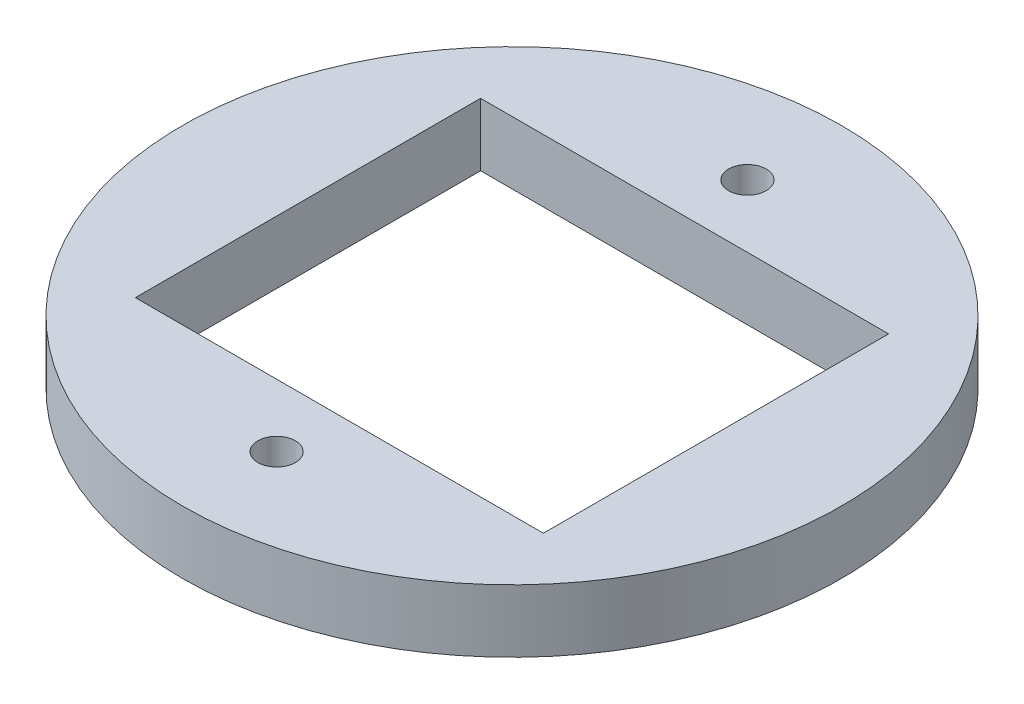
ISO-10303-21;
HEADER;
FILE_DESCRIPTION(('STEP AP214'),'2;1');
FILE_NAME('part.step','',(''),(''),'','','');
FILE_SCHEMA(('AUTOMOTIVE_DESIGN { 1 0 10303 214 1 1 1 1 }'));
ENDSEC;
DATA;
#1=APPLICATION_CONTEXT('core data for automotive mechanical design processes');
#2=APPLICATION_PROTOCOL_DEFINITION('international standard','automotive_design',2000,#1);
#3=PRODUCT_CONTEXT('',#1,'mechanical');
#4=PRODUCT('Part','Part','',(#3));
#5=PRODUCT_RELATED_PRODUCT_CATEGORY('part','',(#4));
#6=PRODUCT_DEFINITION_FORMATION('','',#4);
#7=PRODUCT_DEFINITION_CONTEXT('part definition',#1,'design');
#8=PRODUCT_DEFINITION('design','',#6,#7);
#9=PRODUCT_DEFINITION_SHAPE('','',#8);
#10=(LENGTH_UNIT() NAMED_UNIT(*) SI_UNIT(.MILLI.,.METRE.));
#11=(NAMED_UNIT(*) PLANE_ANGLE_UNIT() SI_UNIT($,.RADIAN.));
#12=(NAMED_UNIT(*) SI_UNIT($,.STERADIAN.) SOLID_ANGLE_UNIT());
#13=UNCERTAINTY_MEASURE_WITH_UNIT(LENGTH_MEASURE(1.E-05),#10,'distance_accuracy_value','');
#14=(GEOMETRIC_REPRESENTATION_CONTEXT(3) GLOBAL_UNCERTAINTY_ASSIGNED_CONTEXT((#13)) GLOBAL_UNIT_ASSIGNED_CONTEXT((#10,
#11,#12)) REPRESENTATION_CONTEXT('',''));
#15=CARTESIAN_POINT('',(0.,0.,0.));
#16=DIRECTION('',(0.,0.,1.));
#17=DIRECTION('',(1.,0.,0.));
#18=AXIS2_PLACEMENT_3D('',#15,#16,#17);
#19=CARTESIAN_POINT('',(0.,5.08,0.));
#20=DIRECTION('',(0.,1.,0.));
#21=DIRECTION('',(0.,0.,1.));
#22=AXIS2_PLACEMENT_3D('',#19,#20,#21);
#23=PLANE('',#22);
#24=CARTESIAN_POINT('',(0.,5.08,19.05));
#25=DIRECTION('',(0.,1.,0.));
#26=DIRECTION('',(0.,0.,1.));
#27=AXIS2_PLACEMENT_3D('',#24,#25,#26);
#28=CIRCLE('',#27,1.524);
#29=CARTESIAN_POINT('',(0.,5.08,20.574));
#30=VERTEX_POINT('',#29);
#31=EDGE_CURVE('E118',#30,#30,#28,.T.);
#32=ORIENTED_EDGE('',*,*,#31,.F.);
#33=EDGE_LOOP('',(#32));
#34=FACE_BOUND('',#33,.T.);
#35=CARTESIAN_POINT('',(0.,5.08,-19.05));
#36=DIRECTION('',(0.,1.,0.));
#37=DIRECTION('',(0.,0.,1.));
#38=AXIS2_PLACEMENT_3D('',#35,#36,#37);
#39=CIRCLE('',#38,1.524);
#40=CARTESIAN_POINT('',(0.,5.08,-17.526));
#41=VERTEX_POINT('',#40);
#42=EDGE_CURVE('E48',#41,#41,#39,.T.);
#43=ORIENTED_EDGE('',*,*,#42,.F.);
#44=EDGE_LOOP('',(#43));
#45=FACE_BOUND('',#44,.T.);
#46=CARTESIAN_POINT('',(0.,5.08,0.));
#47=DIRECTION('',(0.,1.,0.));
#48=DIRECTION('',(0.,0.,1.));
#49=AXIS2_PLACEMENT_3D('',#46,#47,#48);
#50=CIRCLE('',#49,26.67);
#51=CARTESIAN_POINT('',(0.,5.08,26.67));
#52=VERTEX_POINT('',#51);
#53=EDGE_CURVE('E11',#52,#52,#50,.T.);
#54=ORIENTED_EDGE('',*,*,#53,.T.);
#55=EDGE_LOOP('',(#54));
#56=FACE_BOUND('',#55,.T.);
#57=DIRECTION('',(-1.,0.,0.));
#58=VECTOR('',#57,1.);
#59=CARTESIAN_POINT('',(0.,5.08,13.97));
#60=LINE('',#59,#58);
#61=CARTESIAN_POINT('',(16.51,5.08,13.97));
#62=VERTEX_POINT('',#61);
#63=CARTESIAN_POINT('',(-16.51,5.08,13.97));
#64=VERTEX_POINT('',#63);
#65=EDGE_CURVE('E108',#62,#64,#60,.T.);
#66=ORIENTED_EDGE('',*,*,#65,.T.);
#67=DIRECTION('',(0.,0.,-1.));
#68=VECTOR('',#67,1.);
#69=CARTESIAN_POINT('',(-16.51,5.08,0.));
#70=LINE('',#69,#68);
#71=CARTESIAN_POINT('',(-16.51,5.08,-13.97));
#72=VERTEX_POINT('',#71);
#73=EDGE_CURVE('E56',#64,#72,#70,.T.);
#74=ORIENTED_EDGE('',*,*,#73,.T.);
#75=DIRECTION('',(-1.,0.,0.));
#76=VECTOR('',#75,1.);
#77=CARTESIAN_POINT('',(0.,5.08,-13.97));
#78=LINE('',#77,#76);
#79=CARTESIAN_POINT('',(16.51,5.08,-13.97));
#80=VERTEX_POINT('',#79);
#81=EDGE_CURVE('E99',#80,#72,#78,.T.);
#82=ORIENTED_EDGE('',*,*,#81,.F.);
#83=DIRECTION('',(0.,0.,-1.));
#84=VECTOR('',#83,1.);
#85=CARTESIAN_POINT('',(16.51,5.08,0.));
#86=LINE('',#85,#84);
#87=EDGE_CURVE('E102',#62,#80,#86,.T.);
#88=ORIENTED_EDGE('',*,*,#87,.F.);
#89=EDGE_LOOP('',(#66,#74,#82,#88));
#90=FACE_BOUND('',#89,.T.);
#91=ADVANCED_FACE('F39',(#34,#45,#56,#90),#23,.T.);
#92=CARTESIAN_POINT('',(0.,0.,0.));
#93=DIRECTION('',(0.,1.,0.));
#94=DIRECTION('',(0.,0.,1.));
#95=AXIS2_PLACEMENT_3D('',#92,#93,#94);
#96=PLANE('',#95);
#97=CARTESIAN_POINT('',(0.,0.,0.));
#98=DIRECTION('',(0.,1.,0.));
#99=DIRECTION('',(0.,0.,1.));
#100=AXIS2_PLACEMENT_3D('',#97,#98,#99);
#101=CIRCLE('',#100,26.67);
#102=CARTESIAN_POINT('',(0.,0.,26.67));
#103=VERTEX_POINT('',#102);
#104=EDGE_CURVE('E43',#103,#103,#101,.T.);
#105=ORIENTED_EDGE('',*,*,#104,.F.);
#106=EDGE_LOOP('',(#105));
#107=FACE_BOUND('',#106,.T.);
#108=CARTESIAN_POINT('',(0.,0.,-19.05));
#109=DIRECTION('',(0.,1.,0.));
#110=DIRECTION('',(0.,0.,1.));
#111=AXIS2_PLACEMENT_3D('',#108,#109,#110);
#112=CIRCLE('',#111,1.524);
#113=CARTESIAN_POINT('',(0.,0.,-17.526));
#114=VERTEX_POINT('',#113);
#115=EDGE_CURVE('E124',#114,#114,#112,.T.);
#116=ORIENTED_EDGE('',*,*,#115,.T.);
#117=EDGE_LOOP('',(#116));
#118=FACE_BOUND('',#117,.T.);
#119=CARTESIAN_POINT('',(0.,0.,19.05));
#120=DIRECTION('',(0.,1.,0.));
#121=DIRECTION('',(0.,0.,1.));
#122=AXIS2_PLACEMENT_3D('',#119,#120,#121);
#123=CIRCLE('',#122,1.524);
#124=CARTESIAN_POINT('',(0.,0.,20.574));
#125=VERTEX_POINT('',#124);
#126=EDGE_CURVE('E114',#125,#125,#123,.T.);
#127=ORIENTED_EDGE('',*,*,#126,.T.);
#128=EDGE_LOOP('',(#127));
#129=FACE_BOUND('',#128,.T.);
#130=DIRECTION('',(0.,0.,-1.));
#131=VECTOR('',#130,1.);
#132=CARTESIAN_POINT('',(-16.51,0.,0.));
#133=LINE('',#132,#131);
#134=CARTESIAN_POINT('',(-16.51,0.,13.97));
#135=VERTEX_POINT('',#134);
#136=CARTESIAN_POINT('',(-16.51,0.,-13.97));
#137=VERTEX_POINT('',#136);
#138=EDGE_CURVE('E90',#135,#137,#133,.T.);
#139=ORIENTED_EDGE('',*,*,#138,.F.);
#140=DIRECTION('',(-1.,0.,0.));
#141=VECTOR('',#140,1.);
#142=CARTESIAN_POINT('',(0.,0.,13.97));
#143=LINE('',#142,#141);
#144=CARTESIAN_POINT('',(16.51,0.,13.97));
#145=VERTEX_POINT('',#144);
#146=EDGE_CURVE('E82',#145,#135,#143,.T.);
#147=ORIENTED_EDGE('',*,*,#146,.F.);
#148=DIRECTION('',(0.,0.,-1.));
#149=VECTOR('',#148,1.);
#150=CARTESIAN_POINT('',(16.51,0.,0.));
#151=LINE('',#150,#149);
#152=CARTESIAN_POINT('',(16.51,0.,-13.97));
#153=VERTEX_POINT('',#152);
#154=EDGE_CURVE('E64',#145,#153,#151,.T.);
#155=ORIENTED_EDGE('',*,*,#154,.T.);
#156=DIRECTION('',(-1.,0.,0.));
#157=VECTOR('',#156,1.);
#158=CARTESIAN_POINT('',(0.,0.,-13.97));
#159=LINE('',#158,#157);
#160=EDGE_CURVE('E94',#153,#137,#159,.T.);
#161=ORIENTED_EDGE('',*,*,#160,.T.);
#162=EDGE_LOOP('',(#139,#147,#155,#161));
#163=FACE_BOUND('',#162,.T.);
#164=ADVANCED_FACE('F97',(#107,#118,#129,#163),#96,.F.);
#165=CARTESIAN_POINT('',(0.,5.08,-19.05));
#166=DIRECTION('',(0.,-1.,0.));
#167=DIRECTION('',(0.,0.,-1.));
#168=AXIS2_PLACEMENT_3D('',#165,#166,#167);
#169=CYLINDRICAL_SURFACE('',#168,1.524);
#170=ORIENTED_EDGE('',*,*,#42,.T.);
#171=EDGE_LOOP('',(#170));
#172=FACE_BOUND('',#171,.T.);
#173=ORIENTED_EDGE('',*,*,#115,.F.);
#174=EDGE_LOOP('',(#173));
#175=FACE_BOUND('',#174,.T.);
#176=ADVANCED_FACE('F134',(#172,#175),#169,.F.);
#177=CARTESIAN_POINT('',(0.,5.08,19.05));
#178=DIRECTION('',(0.,-1.,0.));
#179=DIRECTION('',(0.,0.,-1.));
#180=AXIS2_PLACEMENT_3D('',#177,#178,#179);
#181=CYLINDRICAL_SURFACE('',#180,1.524);
#182=ORIENTED_EDGE('',*,*,#31,.T.);
#183=EDGE_LOOP('',(#182));
#184=FACE_BOUND('',#183,.T.);
#185=ORIENTED_EDGE('',*,*,#126,.F.);
#186=EDGE_LOOP('',(#185));
#187=FACE_BOUND('',#186,.T.);
#188=ADVANCED_FACE('F41',(#184,#187),#181,.F.);
#189=CARTESIAN_POINT('',(0.,5.08,0.));
#190=DIRECTION('',(0.,-1.,0.));
#191=DIRECTION('',(0.,0.,-1.));
#192=AXIS2_PLACEMENT_3D('',#189,#190,#191);
#193=CYLINDRICAL_SURFACE('',#192,26.67);
#194=ORIENTED_EDGE('',*,*,#53,.F.);
#195=EDGE_LOOP('',(#194));
#196=FACE_BOUND('',#195,.T.);
#197=ORIENTED_EDGE('',*,*,#104,.T.);
#198=EDGE_LOOP('',(#197));
#199=FACE_BOUND('',#198,.T.);
#200=ADVANCED_FACE('F131',(#196,#199),#193,.T.);
#201=CARTESIAN_POINT('',(-16.51,0.,0.));
#202=DIRECTION('',(1.,0.,0.));
#203=DIRECTION('',(0.,0.,-1.));
#204=AXIS2_PLACEMENT_3D('',#201,#202,#203);
#205=PLANE('',#204);
#206=ORIENTED_EDGE('',*,*,#73,.F.);
#207=DIRECTION('',(0.,1.,0.));
#208=VECTOR('',#207,1.);
#209=CARTESIAN_POINT('',(-16.51,0.,13.97));
#210=LINE('',#209,#208);
#211=EDGE_CURVE('E85',#135,#64,#210,.T.);
#212=ORIENTED_EDGE('',*,*,#211,.F.);
#213=ORIENTED_EDGE('',*,*,#138,.T.);
#214=DIRECTION('',(0.,1.,0.));
#215=VECTOR('',#214,1.);
#216=CARTESIAN_POINT('',(-16.51,0.,-13.97));
#217=LINE('',#216,#215);
#218=EDGE_CURVE('E112',#137,#72,#217,.T.);
#219=ORIENTED_EDGE('',*,*,#218,.T.);
#220=EDGE_LOOP('',(#206,#212,#213,#219));
#221=FACE_BOUND('',#220,.T.);
#222=ADVANCED_FACE('F92',(#221),#205,.T.);
#223=CARTESIAN_POINT('',(0.,0.,-13.97));
#224=DIRECTION('',(0.,0.,-1.));
#225=DIRECTION('',(-1.,0.,0.));
#226=AXIS2_PLACEMENT_3D('',#223,#224,#225);
#227=PLANE('',#226);
#228=ORIENTED_EDGE('',*,*,#81,.T.);
#229=ORIENTED_EDGE('',*,*,#218,.F.);
#230=ORIENTED_EDGE('',*,*,#160,.F.);
#231=DIRECTION('',(0.,1.,0.));
#232=VECTOR('',#231,1.);
#233=CARTESIAN_POINT('',(16.51,0.,-13.97));
#234=LINE('',#233,#232);
#235=EDGE_CURVE('E115',#153,#80,#234,.T.);
#236=ORIENTED_EDGE('',*,*,#235,.T.);
#237=EDGE_LOOP('',(#228,#229,#230,#236));
#238=FACE_BOUND('',#237,.T.);
#239=ADVANCED_FACE('F158',(#238),#227,.F.);
#240=CARTESIAN_POINT('',(16.51,0.,0.));
#241=DIRECTION('',(1.,0.,0.));
#242=DIRECTION('',(0.,0.,-1.));
#243=AXIS2_PLACEMENT_3D('',#240,#241,#242);
#244=PLANE('',#243);
#245=ORIENTED_EDGE('',*,*,#87,.T.);
#246=ORIENTED_EDGE('',*,*,#235,.F.);
#247=ORIENTED_EDGE('',*,*,#154,.F.);
#248=DIRECTION('',(0.,1.,0.));
#249=VECTOR('',#248,1.);
#250=CARTESIAN_POINT('',(16.51,0.,13.97));
#251=LINE('',#250,#249);
#252=EDGE_CURVE('E87',#145,#62,#251,.T.);
#253=ORIENTED_EDGE('',*,*,#252,.T.);
#254=EDGE_LOOP('',(#245,#246,#247,#253));
#255=FACE_BOUND('',#254,.T.);
#256=ADVANCED_FACE('F161',(#255),#244,.F.);
#257=CARTESIAN_POINT('',(0.,0.,13.97));
#258=DIRECTION('',(0.,0.,-1.));
#259=DIRECTION('',(-1.,0.,0.));
#260=AXIS2_PLACEMENT_3D('',#257,#258,#259);
#261=PLANE('',#260);
#262=ORIENTED_EDGE('',*,*,#65,.F.);
#263=ORIENTED_EDGE('',*,*,#252,.F.);
#264=ORIENTED_EDGE('',*,*,#146,.T.);
#265=ORIENTED_EDGE('',*,*,#211,.T.);
#266=EDGE_LOOP('',(#262,#263,#264,#265));
#267=FACE_BOUND('',#266,.T.);
#268=ADVANCED_FACE('F84',(#267),#261,.T.);
#269=CLOSED_SHELL('',(#91,#164,#176,#188,#200,#222,#239,#256,#268));
#270=MANIFOLD_SOLID_BREP('B2',#269);
#271=ADVANCED_BREP_SHAPE_REPRESENTATION('',(#18,#270),#14);
#272=SHAPE_DEFINITION_REPRESENTATION(#9,#271);
ENDSEC;
END-ISO-10303-21;
